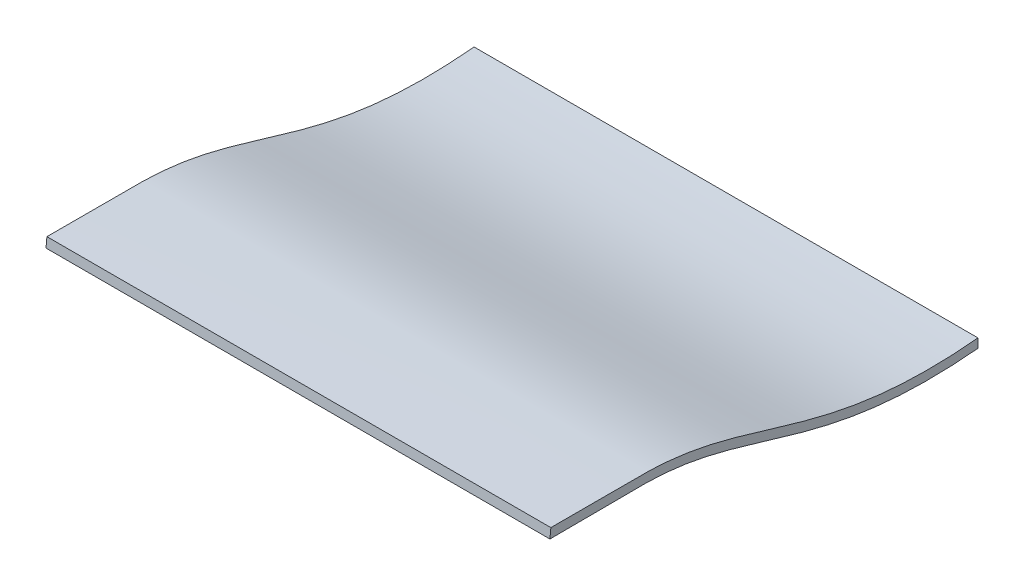
ISO-10303-21;
HEADER;
FILE_DESCRIPTION(('STEP AP214'),'2;1');
FILE_NAME('part.step','',(''),(''),'','','');
FILE_SCHEMA(('AUTOMOTIVE_DESIGN { 1 0 10303 214 1 1 1 1 }'));
ENDSEC;
DATA;
#1=APPLICATION_CONTEXT('core data for automotive mechanical design processes');
#2=APPLICATION_PROTOCOL_DEFINITION('international standard','automotive_design',2000,#1);
#3=PRODUCT_CONTEXT('',#1,'mechanical');
#4=PRODUCT('Part','Part','',(#3));
#5=PRODUCT_RELATED_PRODUCT_CATEGORY('part','',(#4));
#6=PRODUCT_DEFINITION_FORMATION('','',#4);
#7=PRODUCT_DEFINITION_CONTEXT('part definition',#1,'design');
#8=PRODUCT_DEFINITION('design','',#6,#7);
#9=PRODUCT_DEFINITION_SHAPE('','',#8);
#10=(LENGTH_UNIT() NAMED_UNIT(*) SI_UNIT(.MILLI.,.METRE.));
#11=(NAMED_UNIT(*) PLANE_ANGLE_UNIT() SI_UNIT($,.RADIAN.));
#12=(NAMED_UNIT(*) SI_UNIT($,.STERADIAN.) SOLID_ANGLE_UNIT());
#13=UNCERTAINTY_MEASURE_WITH_UNIT(LENGTH_MEASURE(1.E-05),#10,'distance_accuracy_value','');
#14=(GEOMETRIC_REPRESENTATION_CONTEXT(3) GLOBAL_UNCERTAINTY_ASSIGNED_CONTEXT((#13)) GLOBAL_UNIT_ASSIGNED_CONTEXT((#10,
#11,#12)) REPRESENTATION_CONTEXT('',''));
#15=CARTESIAN_POINT('',(0.,0.,0.));
#16=DIRECTION('',(0.,0.,1.));
#17=DIRECTION('',(1.,0.,0.));
#18=AXIS2_PLACEMENT_3D('',#15,#16,#17);
#19=CARTESIAN_POINT('',(2.8672,0.,4.));
#20=CARTESIAN_POINT('',(-3.92,0.,4.));
#21=CARTESIAN_POINT('',(2.8672,-0.024628468,4.256388466));
#22=CARTESIAN_POINT('',(-3.92,-0.024628468,4.256388466));
#23=CARTESIAN_POINT('',(2.8672,-0.038618016,4.72259081));
#24=CARTESIAN_POINT('',(-3.92,-0.038618016,4.72259081));
#25=CARTESIAN_POINT('',(2.8672,0.01947153,5.312011185));
#26=CARTESIAN_POINT('',(-3.92,0.01947153,5.312011185));
#27=CARTESIAN_POINT('',(2.8672,0.129906645,5.821389043));
#28=CARTESIAN_POINT('',(-3.92,0.129906645,5.821389043));
#29=CARTESIAN_POINT('',(2.8672,0.291873769,6.368027096));
#30=CARTESIAN_POINT('',(-3.92,0.291873769,6.368027096));
#31=CARTESIAN_POINT('',(2.8672,0.477782991,6.965975593));
#32=CARTESIAN_POINT('',(-3.92,0.477782991,6.965975593));
#33=CARTESIAN_POINT('',(2.8672,0.547843022,7.463268805));
#34=CARTESIAN_POINT('',(-3.92,0.547843022,7.463268805));
#35=CARTESIAN_POINT('',(2.8672,0.547843022,7.742133946));
#36=CARTESIAN_POINT('',(-3.92,0.547843022,7.742133946));
#37=CARTESIAN_POINT('',(2.8672,0.547843022,8.57930318693468));
#38=CARTESIAN_POINT('',(-3.92,0.547843022,8.57930318693468));
#39=CARTESIAN_POINT('',(2.8672,0.547843022,9.41647242786936));
#40=CARTESIAN_POINT('',(-3.92,0.547843022,9.41647242786936));
#41=CARTESIAN_POINT('',(2.8672,0.547843022,10.253641668804));
#42=CARTESIAN_POINT('',(-3.92,0.547843022,10.253641668804));
#43=B_SPLINE_SURFACE_WITH_KNOTS('',3,1,((#19,#20),(#21,#22),(#23,#24),(#25,#26),(#27,#28),(#29,
#30),(#31,#32),(#33,#34),(#35,#36),(#37,#38),(#39,#40),(#41,#42)),.UNSPECIFIED.,.F.,.F.,.F.,(4,
1,1,1,1,1,3,4),(2,2),(0.,0.14,0.28,0.42,0.559999999997895,0.780000000000162,1.,
1.66045269173853),(-0.00672,0.672),.UNSPECIFIED.);
#44=CARTESIAN_POINT('',(-2.8,0.547843022,8.74673703512159));
#45=CARTESIAN_POINT('',(-2.8,0.547842906702326,8.68528571674755));
#46=CARTESIAN_POINT('',(-2.8,0.547842964198973,8.62383439827284));
#47=CARTESIAN_POINT('',(-2.8,0.547843080107016,8.50060644710681));
#48=CARTESIAN_POINT('',(-2.8,0.547843138521643,8.43882981441547));
#49=CARTESIAN_POINT('',(-2.8,0.547842905081755,8.31506628140649));
#50=CARTESIAN_POINT('',(-2.8,0.54784261203436,8.25307938108954));
#51=CARTESIAN_POINT('',(-2.8,0.54784343259541,8.12901035819153));
#52=CARTESIAN_POINT('',(-2.8,0.547844548365387,8.06692823560921));
#53=CARTESIAN_POINT('',(-2.8,0.54784228226672,7.97475881607305));
#54=CARTESIAN_POINT('',(-2.8,0.547840921966892,7.94467151794153));
#55=CARTESIAN_POINT('',(-2.8,0.547845122145863,7.88449530220247));
#56=CARTESIAN_POINT('',(-2.8,0.547850682996255,7.85440638459473));
#57=CARTESIAN_POINT('',(-2.8,0.547839196398691,7.80929225221311));
#58=CARTESIAN_POINT('',(-2.8,0.547832073781566,7.79426703165736));
#59=CARTESIAN_POINT('',(-2.8,0.547853970254236,7.76421652035728));
#60=CARTESIAN_POINT('',(-2.8,0.547882989462217,7.74919122961287));
#61=CARTESIAN_POINT('',(-2.8,0.547783984428342,7.71914228667047));
#62=CARTESIAN_POINT('',(-2.8,0.547655976451005,7.70411863446392));
#63=CARTESIAN_POINT('',(-2.8,0.547182678089916,7.67407502080611));
#64=CARTESIAN_POINT('',(-2.8,0.546837390533576,7.65905505930935));
#65=CARTESIAN_POINT('',(-2.8,0.545498104294444,7.61408616045096));
#66=CARTESIAN_POINT('',(-2.8,0.544200462391214,7.58414561436942));
#67=CARTESIAN_POINT('',(-2.8,0.540781918126866,7.5243089237964));
#68=CARTESIAN_POINT('',(-2.8,0.538660916387852,7.49441278510221));
#69=CARTESIAN_POINT('',(-2.8,0.531084497477442,7.40491049720686));
#70=CARTESIAN_POINT('',(-2.8,0.524413060488041,7.3454037577374));
#71=CARTESIAN_POINT('',(-2.8,0.505054373277433,7.20553805547719));
#72=CARTESIAN_POINT('',(-2.8,0.49106741739192,7.12535976173874));
#73=CARTESIAN_POINT('',(-2.8,0.458348257888318,6.96576026035285));
#74=CARTESIAN_POINT('',(-2.8,0.439602277869368,6.88634195742287));
#75=CARTESIAN_POINT('',(-2.8,0.398804162548757,6.72826779878592));
#76=CARTESIAN_POINT('',(-2.8,0.376747614363769,6.6496131122451));
#77=CARTESIAN_POINT('',(-2.8,0.330896653138866,6.49237475511494));
#78=CARTESIAN_POINT('',(-2.8,0.307093689085984,6.41379364626243));
#79=CARTESIAN_POINT('',(-2.8,0.259573871282777,6.25673118750272));
#80=CARTESIAN_POINT('',(-2.8,0.235856942343488,6.17824986110475));
#81=CARTESIAN_POINT('',(-2.8,0.189972865135392,6.02085254458342));
#82=CARTESIAN_POINT('',(-2.8,0.167805232549242,5.94193669869016));
#83=CARTESIAN_POINT('',(-2.8,0.126099769165425,5.78297462889497));
#84=CARTESIAN_POINT('',(-2.8,0.106575783383594,5.70292470923044));
#85=CARTESIAN_POINT('',(-2.8,0.0711327721986367,5.54198267820483));
#86=CARTESIAN_POINT('',(-2.8,0.0552153901064553,5.46109020042868));
#87=CARTESIAN_POINT('',(-2.8,0.0274831509551212,5.29860395630055));
#88=CARTESIAN_POINT('',(-2.8,0.0156681085146804,5.21701022180858));
#89=CARTESIAN_POINT('',(-2.8,-0.00365394145678587,5.05365115991832));
#90=CARTESIAN_POINT('',(-2.8,-0.0111783002128884,4.97188788512288));
#91=CARTESIAN_POINT('',(-2.8,-0.0220647987660413,4.80807822579403));
#92=CARTESIAN_POINT('',(-2.8,-0.0254264454305133,4.72603180887268));
#93=CARTESIAN_POINT('',(-2.8,-0.0282081796048502,4.56189899319011));
#94=CARTESIAN_POINT('',(-2.8,-0.0276293976794587,4.47981261265323));
#95=CARTESIAN_POINT('',(-2.8,-0.0232940887268819,4.33140886200852));
#96=CARTESIAN_POINT('',(-2.8,-0.0201650529801226,4.26507158041845));
#97=CARTESIAN_POINT('',(-2.8,-0.0116978988822259,4.13245532577286));
#98=CARTESIAN_POINT('',(-2.8,-0.00635707039965284,4.06617652456653));
#99=CARTESIAN_POINT('',(-2.8,0.,4.));
#100=B_SPLINE_CURVE_WITH_KNOTS('',3,(#44,#45,#46,#47,#48,#49,#50,#51,#52,#53,#54,#55,#56,#57,
#58,#59,#60,#61,#62,#63,#64,#65,#66,#67,#68,#69,#70,#71,#72,#73,#74,#75,#76,#77,#78,#79,#80,#81,
#82,#83,#84,#85,#86,#87,#88,#89,#90,#91,#92,#93,#94,#95,#96,#97,#98,#99),.UNSPECIFIED.,.F.,.F.,
(4,2,2,2,2,2,2,2,2,2,2,2,2,2,2,2,2,2,2,2,2,2,2,2,2,2,2,4),(0.,0.184353955323629,
0.369683853295539,0.555644554758549,0.741890920555486,0.832152817327458,0.922419560432007,
0.967495234547427,1.01257105606386,1.05764220912332,1.10271277569349,1.19260620618809,
1.28251049001648,1.46205914291478,1.70604383123385,1.95074302330179,2.19577133701712,
2.44209177025096,2.68804945864641,2.93392991238468,3.18105199234312,3.42828644545333,
3.67550972479147,3.92172602834634,4.16797149694215,4.4141463172052,4.61334321924149,
4.81278492478183),.UNSPECIFIED.);
#101=CARTESIAN_POINT('',(-2.8,0.547843022,8.7467370351216));
#102=VERTEX_POINT('',#101);
#103=CARTESIAN_POINT('',(-2.8,0.,4.));
#104=VERTEX_POINT('',#103);
#105=EDGE_CURVE('E23',#102,#104,#100,.T.);
#106=DIRECTION('',(1.,0.,0.));
#107=VECTOR('',#106,1.);
#108=CARTESIAN_POINT('',(0.,0.547843022,8.74673703512162));
#109=LINE('',#108,#107);
#110=CARTESIAN_POINT('',(2.8,0.547843022,8.7467370351216));
#111=VERTEX_POINT('',#110);
#112=EDGE_CURVE('E64',#111,#102,#109,.F.);
#113=CARTESIAN_POINT('',(2.8,0.,4.));
#114=CARTESIAN_POINT('',(2.8,-0.00884743046204992,4.09205858219701));
#115=CARTESIAN_POINT('',(2.8,-0.0157227959919003,4.18433034520398));
#116=CARTESIAN_POINT('',(2.8,-0.0250705776314633,4.36921030327923));
#117=CARTESIAN_POINT('',(2.8,-0.0275374015249569,4.46181877654538));
#118=CARTESIAN_POINT('',(2.8,-0.0275844910846493,4.64707318642334));
#119=CARTESIAN_POINT('',(2.8,-0.0251634165216857,4.73971912634436));
#120=CARTESIAN_POINT('',(2.8,-0.0151702693742893,4.92285018551999));
#121=CARTESIAN_POINT('',(2.8,-0.00770377228910637,5.01334098714492));
#122=CARTESIAN_POINT('',(2.8,0.0124057404538056,5.19368091528302));
#123=CARTESIAN_POINT('',(2.8,0.0250450581813154,5.28353045363163));
#124=CARTESIAN_POINT('',(2.8,0.055295524818302,5.46228799230291));
#125=CARTESIAN_POINT('',(2.8,0.0729015629968635,5.55119686350463));
#126=CARTESIAN_POINT('',(2.8,0.106902452484785,5.70333505026525));
#127=CARTESIAN_POINT('',(2.8,0.122261992695236,5.76680053179104));
#128=CARTESIAN_POINT('',(2.8,0.154795780809255,5.89326590331332));
#129=CARTESIAN_POINT('',(2.8,0.17197015648176,5.95626576019416));
#130=CARTESIAN_POINT('',(2.8,0.207609416509552,6.0820341866934));
#131=CARTESIAN_POINT('',(2.8,0.226076861143274,6.14480202266021));
#132=CARTESIAN_POINT('',(2.8,0.263576065434319,6.2701696677427));
#133=CARTESIAN_POINT('',(2.8,0.282607881064201,6.33276945951636));
#134=CARTESIAN_POINT('',(2.8,0.339342837832746,6.52067130538712));
#135=CARTESIAN_POINT('',(2.8,0.376693554934573,6.64610182510756));
#136=CARTESIAN_POINT('',(2.8,0.426789565151415,6.83559559014639));
#137=CARTESIAN_POINT('',(2.8,0.44247493218745,6.89885962548878));
#138=CARTESIAN_POINT('',(2.8,0.471129988229087,7.02599107732407));
#139=CARTESIAN_POINT('',(2.8,0.484100341283253,7.08985834227338));
#140=CARTESIAN_POINT('',(2.8,0.506767336079929,7.21851795518392));
#141=CARTESIAN_POINT('',(2.8,0.516447085169036,7.28331334847186));
#142=CARTESIAN_POINT('',(2.8,0.528146294018996,7.38088824719804));
#143=CARTESIAN_POINT('',(2.8,0.531577558503533,7.41350283404392));
#144=CARTESIAN_POINT('',(2.8,0.537472390646986,7.47881643158059));
#145=CARTESIAN_POINT('',(2.8,0.539936073128194,7.51151543179027));
#146=CARTESIAN_POINT('',(2.8,0.543880754246365,7.57707670126507));
#147=CARTESIAN_POINT('',(2.8,0.545358615569614,7.60993915961647));
#148=CARTESIAN_POINT('',(2.8,0.54685117899047,7.6592557233188));
#149=CARTESIAN_POINT('',(2.8,0.547227996356305,7.67569950172081));
#150=CARTESIAN_POINT('',(2.8,0.547705404736432,7.70859144176619));
#151=CARTESIAN_POINT('',(2.8,0.547805987776157,7.72503960352237));
#152=CARTESIAN_POINT('',(2.8,0.547880023412574,7.75797686300814));
#153=CARTESIAN_POINT('',(2.8,0.547853156827478,7.77446596004081));
#154=CARTESIAN_POINT('',(2.8,0.547832887290195,7.80744403579182));
#155=CARTESIAN_POINT('',(2.8,0.547839483949478,7.82393301450929));
#156=CARTESIAN_POINT('',(2.8,0.547850097794964,7.87339850412885));
#157=CARTESIAN_POINT('',(2.8,0.547844940213279,7.90637499497928));
#158=CARTESIAN_POINT('',(2.8,0.547841054617476,7.97317327197277));
#159=CARTESIAN_POINT('',(2.8,0.547842494800152,8.00699505848345));
#160=CARTESIAN_POINT('',(2.8,0.547843549206849,8.07463907667339));
#161=CARTESIAN_POINT('',(2.8,0.547843163406621,8.1084613083526));
#162=CARTESIAN_POINT('',(2.8,0.547842880860223,8.17604194794232));
#163=CARTESIAN_POINT('',(2.8,0.54784298319255,8.20980035585081));
#164=CARTESIAN_POINT('',(2.8,0.547843060807309,8.27731704928939));
#165=CARTESIAN_POINT('',(2.8,0.547843036090201,8.31107533481947));
#166=CARTESIAN_POINT('',(2.8,0.547842993944022,8.41205208752087));
#167=CARTESIAN_POINT('',(2.8,0.547843008021134,8.47927055476103));
#168=CARTESIAN_POINT('',(2.8,0.547843035881305,8.61323835973819));
#169=CARTESIAN_POINT('',(2.8,0.54784304966573,8.67998769747519));
#170=CARTESIAN_POINT('',(2.8,0.547843022,8.74673703512159));
#171=B_SPLINE_CURVE_WITH_KNOTS('',3,(#113,#114,#115,#116,#117,#118,#119,#120,#121,#122,#123,
#124,#125,#126,#127,#128,#129,#130,#131,#132,#133,#134,#135,#136,#137,#138,#139,#140,#141,#142,
#143,#144,#145,#146,#147,#148,#149,#150,#151,#152,#153,#154,#155,#156,#157,#158,#159,#160,#161,
#162,#163,#164,#165,#166,#167,#168,#169,#170),.UNSPECIFIED.,.F.,.F.,(4,2,2,2,2,2,2,2,2,2,2,2,2,
2,2,2,2,2,2,2,2,2,2,2,2,2,2,2,4),(0.,0.277462266606104,0.5552762437618,0.833166406002992,
1.10541473416526,1.37746877728997,1.64924389290612,1.84510669939396,2.04098330430982,
2.23725935523744,2.43355493774901,2.82606442173887,3.02155488316188,3.21699747476353,
3.41342875254236,3.51180035622406,3.61016028268545,3.70883175873313,3.7581741608985,
3.80751798750718,3.85698545475782,3.9064523476588,4.0053818540261,4.10684720411547,
4.20831390168262,4.30958912473716,4.41086398148947,4.61251938311767,4.81276739623828),.UNSPECIFIED.);
#172=CARTESIAN_POINT('',(2.8,0.,4.));
#173=VERTEX_POINT('',#172);
#174=EDGE_CURVE('E77',#173,#111,#171,.T.);
#175=DIRECTION('',(1.,0.,0.));
#176=VECTOR('',#175,1.);
#177=CARTESIAN_POINT('',(0.,0.,4.));
#178=LINE('',#177,#176);
#179=EDGE_CURVE('E66',#173,#104,#178,.F.);
#180=ORIENTED_EDGE('',*,*,#105,.F.);
#181=ORIENTED_EDGE('',*,*,#112,.F.);
#182=ORIENTED_EDGE('',*,*,#174,.F.);
#183=ORIENTED_EDGE('',*,*,#179,.T.);
#184=EDGE_LOOP('',(#180,#181,#182,#183));
#185=FACE_BOUND('',#184,.T.);
#186=ADVANCED_FACE('F16',(#185),#43,.F.);
#187=CARTESIAN_POINT('',(-2.8,0.192627967,4.));
#188=DIRECTION('',(-1.,0.,0.));
#189=DIRECTION('',(0.,0.,1.));
#190=AXIS2_PLACEMENT_3D('',#187,#188,#189);
#191=PLANE('',#190);
#192=DIRECTION('',(0.,-0.995418002222509,0.095619040213487));
#193=VECTOR('',#192,1.);
#194=CARTESIAN_POINT('',(-2.8,0.543920262213487,8.74711385222251));
#195=LINE('',#194,#193);
#196=CARTESIAN_POINT('',(-2.8,0.442668977260629,8.75683996795073));
#197=VERTEX_POINT('',#196);
#198=EDGE_CURVE('E71',#102,#197,#195,.T.);
#199=ORIENTED_EDGE('',*,*,#198,.F.);
#200=ORIENTED_EDGE('',*,*,#105,.T.);
#201=DIRECTION('',(0.,1.,0.));
#202=VECTOR('',#201,1.);
#203=CARTESIAN_POINT('',(-2.8,-0.1,4.));
#204=LINE('',#203,#202);
#205=CARTESIAN_POINT('',(-2.8,-0.1,4.));
#206=VERTEX_POINT('',#205);
#207=EDGE_CURVE('E85',#104,#206,#204,.F.);
#208=ORIENTED_EDGE('',*,*,#207,.T.);
#209=CARTESIAN_POINT('',(-2.8,-0.1,4.));
#210=CARTESIAN_POINT('',(-2.8,-0.108905872787101,4.09474520944262));
#211=CARTESIAN_POINT('',(-2.8,-0.115789153962948,4.1897074515527));
#212=CARTESIAN_POINT('',(-2.8,-0.124989931256523,4.37995403207937));
#213=CARTESIAN_POINT('',(-2.8,-0.127302369388049,4.47523861056854));
#214=CARTESIAN_POINT('',(-2.8,-0.126818780818783,4.66582542472838));
#215=CARTESIAN_POINT('',(-2.8,-0.12402178582099,4.7611276603228));
#216=CARTESIAN_POINT('',(-2.8,-0.113048144902698,4.94950631638367));
#217=CARTESIAN_POINT('',(-2.8,-0.104980517394534,5.04258904340113));
#218=CARTESIAN_POINT('',(-2.8,-0.0834777878587851,5.22807357373039));
#219=CARTESIAN_POINT('',(-2.8,-0.0700463112012425,5.32047579411537));
#220=CARTESIAN_POINT('',(-2.8,-0.0460659967579736,5.45835332332887));
#221=CARTESIAN_POINT('',(-2.8,-0.0374381554607821,5.5041723570409));
#222=CARTESIAN_POINT('',(-2.8,-0.0189857232088821,5.59556286418674));
#223=CARTESIAN_POINT('',(-2.8,-0.00916129651699088,5.64113437070498));
#224=CARTESIAN_POINT('',(-2.8,0.0155671182570966,5.74947932695414));
#225=CARTESIAN_POINT('',(-2.8,0.0309729127038378,5.81213799274748));
#226=CARTESIAN_POINT('',(-2.8,0.0634872313896632,5.93701426318799));
#227=CARTESIAN_POINT('',(-2.8,0.0805959248745248,5.99923182333544));
#228=CARTESIAN_POINT('',(-2.8,0.133701177283009,6.18543382773715));
#229=CARTESIAN_POINT('',(-2.8,0.171461549029286,6.30890481440444));
#230=CARTESIAN_POINT('',(-2.8,0.227310585281221,6.49434791357856));
#231=CARTESIAN_POINT('',(-2.8,0.245796046913832,6.55620526739254));
#232=CARTESIAN_POINT('',(-2.8,0.281686067422485,6.68022985177974));
#233=CARTESIAN_POINT('',(-2.8,0.299090780495993,6.74239703677372));
#234=CARTESIAN_POINT('',(-2.8,0.331921619369486,6.86699277584998));
#235=CARTESIAN_POINT('',(-2.8,0.347355388066259,6.929419286883));
#236=CARTESIAN_POINT('',(-2.8,0.375539412252017,7.05487328306878));
#237=CARTESIAN_POINT('',(-2.8,0.388290363935862,7.11790060786076));
#238=CARTESIAN_POINT('',(-2.8,0.404923055608675,7.21310745048152));
#239=CARTESIAN_POINT('',(-2.8,0.410065411026173,7.24506855513573));
#240=CARTESIAN_POINT('',(-2.8,0.419429875752844,7.30912827829778));
#241=CARTESIAN_POINT('',(-2.8,0.423651930908881,7.34122690478454));
#242=CARTESIAN_POINT('',(-2.8,0.431130256220014,7.40558404973198));
#243=CARTESIAN_POINT('',(-2.8,0.434385107610895,7.43784273319446));
#244=CARTESIAN_POINT('',(-2.8,0.439889206173268,7.50244171907489));
#245=CARTESIAN_POINT('',(-2.8,0.442138605108399,7.5347820084336));
#246=CARTESIAN_POINT('',(-2.8,0.444751922462403,7.58338740533369));
#247=CARTESIAN_POINT('',(-2.8,0.445496849948542,7.59963287809563));
#248=CARTESIAN_POINT('',(-2.8,0.446730992637988,7.6321329865827));
#249=CARTESIAN_POINT('',(-2.8,0.447220218773499,7.64838762188634));
#250=CARTESIAN_POINT('',(-2.8,0.447941961489845,7.68090518168157));
#251=CARTESIAN_POINT('',(-2.8,0.448174436850442,7.69716810708491));
#252=CARTESIAN_POINT('',(-2.8,0.448337242978448,7.7215639524491));
#253=CARTESIAN_POINT('',(-2.8,0.448360525648154,7.72969632518401));
#254=CARTESIAN_POINT('',(-2.8,0.448336315686042,7.74596101646417));
#255=CARTESIAN_POINT('',(-2.8,0.448288822166695,7.75409333500745));
#256=CARTESIAN_POINT('',(-2.8,0.448148783420142,7.77853033934389));
#257=CARTESIAN_POINT('',(-2.8,0.448058927320061,7.79483498451979));
#258=CARTESIAN_POINT('',(-2.8,0.447877341397791,7.82744397730012));
#259=CARTESIAN_POINT('',(-2.8,0.44778561161309,7.84374832490398));
#260=CARTESIAN_POINT('',(-2.8,0.447510947642803,7.89265936329145));
#261=CARTESIAN_POINT('',(-2.8,0.447328527544684,7.92526604631015));
#262=CARTESIAN_POINT('',(-2.8,0.446958450186208,7.99134991848952));
#263=CARTESIAN_POINT('',(-2.8,0.446770783125569,8.02482710779822));
#264=CARTESIAN_POINT('',(-2.8,0.44639554540241,8.09178213059635));
#265=CARTESIAN_POINT('',(-2.8,0.44620797474182,8.12525996408576));
#266=CARTESIAN_POINT('',(-2.8,0.445645979505342,8.2255606697448));
#267=CARTESIAN_POINT('',(-2.8,0.445271527753725,8.29238354232488));
#268=CARTESIAN_POINT('',(-2.8,0.444524370254195,8.42572094308319));
#269=CARTESIAN_POINT('',(-2.8,0.444151664422522,8.49223547126267));
#270=CARTESIAN_POINT('',(-2.8,0.443408967767523,8.6247799889004));
#271=CARTESIAN_POINT('',(-2.8,0.443038976944517,8.69080997835864));
#272=CARTESIAN_POINT('',(-2.8,0.442668977260629,8.75683996795071));
#273=B_SPLINE_CURVE_WITH_KNOTS('',3,(#209,#210,#211,#212,#213,#214,#215,#216,#217,#218,#219,
#220,#221,#222,#223,#224,#225,#226,#227,#228,#229,#230,#231,#232,#233,#234,#235,#236,#237,#238,
#239,#240,#241,#242,#243,#244,#245,#246,#247,#248,#249,#250,#251,#252,#253,#254,#255,#256,#257,
#258,#259,#260,#261,#262,#263,#264,#265,#266,#267,#268,#269,#270,#271,#272),.UNSPECIFIED.,.F.,
.F.,(4,2,2,2,2,2,2,2,2,2,2,2,2,2,2,2,2,2,2,2,2,2,2,2,2,2,2,2,2,2,2,4),(0.,0.285506980144167,
0.571329719045214,0.85720663029884,1.13735004307945,1.41730442942976,1.55716367382693,
1.69700374045805,1.89054662021298,2.08410875482945,2.47142674369267,2.66510793330223,
2.85876142535276,3.05163956399039,3.24446758857313,3.34157265237801,3.43868342858493,
3.53593595856488,3.63317380422444,3.68195977354655,3.73074365691247,3.77953537118399,
3.80393231666072,3.82832956807602,3.87724433973849,3.92615813368494,4.02397973151109,
4.12441287247664,4.22484795054686,4.42531971476556,4.62486643208221,4.82295951041181),.UNSPECIFIED.);
#274=EDGE_CURVE('E81',#206,#197,#273,.T.);
#275=ORIENTED_EDGE('',*,*,#274,.T.);
#276=EDGE_LOOP('',(#199,#200,#208,#275));
#277=FACE_BOUND('',#276,.T.);
#278=ADVANCED_FACE('F80',(#277),#191,.T.);
#279=CARTESIAN_POINT('',(0.,0.543920262213487,8.74711385222251));
#280=DIRECTION('',(0.,0.095619040213487,0.995418002222509));
#281=DIRECTION('',(0.,-0.995418002222509,0.095619040213487));
#282=AXIS2_PLACEMENT_3D('',#279,#280,#281);
#283=PLANE('',#282);
#284=DIRECTION('',(0.,-0.995418002222516,0.0956190402134144));
#285=VECTOR('',#284,1.);
#286=CARTESIAN_POINT('',(2.8,0.547843022,8.74673703512162));
#287=LINE('',#286,#285);
#288=CARTESIAN_POINT('',(2.8,0.442668977260628,8.75683996795072));
#289=VERTEX_POINT('',#288);
#290=EDGE_CURVE('E76',#111,#289,#287,.T.);
#291=ORIENTED_EDGE('',*,*,#290,.F.);
#292=ORIENTED_EDGE('',*,*,#112,.T.);
#293=ORIENTED_EDGE('',*,*,#198,.T.);
#294=DIRECTION('',(1.,0.,0.));
#295=VECTOR('',#294,1.);
#296=CARTESIAN_POINT('',(0.5264,0.442668977260628,8.75683996795073));
#297=LINE('',#296,#295);
#298=EDGE_CURVE('E94',#197,#289,#297,.T.);
#299=ORIENTED_EDGE('',*,*,#298,.T.);
#300=EDGE_LOOP('',(#291,#292,#293,#299));
#301=FACE_BOUND('',#300,.T.);
#302=ADVANCED_FACE('F73',(#301),#283,.T.);
#303=CARTESIAN_POINT('',(2.8,0.192627967,4.));
#304=DIRECTION('',(1.,0.,0.));
#305=DIRECTION('',(0.,0.,-1.));
#306=AXIS2_PLACEMENT_3D('',#303,#304,#305);
#307=PLANE('',#306);
#308=ORIENTED_EDGE('',*,*,#290,.T.);
#309=CARTESIAN_POINT('',(2.8,0.442668977260628,8.75683996795071));
#310=CARTESIAN_POINT('',(2.8,0.443022769517232,8.69370434357405));
#311=CARTESIAN_POINT('',(2.8,0.443376536561082,8.63056871826974));
#312=CARTESIAN_POINT('',(2.8,0.444086461082776,8.50387083457539));
#313=CARTESIAN_POINT('',(2.8,0.444442618559852,8.44030857618531));
#314=CARTESIAN_POINT('',(2.8,0.44515652455737,8.31290927456473));
#315=CARTESIAN_POINT('',(2.8,0.445514273299738,8.24907223134241));
#316=CARTESIAN_POINT('',(2.8,0.446230253443424,8.12127519693405));
#317=CARTESIAN_POINT('',(2.8,0.446588484447419,8.0573152057334));
#318=CARTESIAN_POINT('',(2.8,0.447121825118356,7.9621933600159));
#319=CARTESIAN_POINT('',(2.8,0.447296639243029,7.93103149462533));
#320=CARTESIAN_POINT('',(2.8,0.447645259326617,7.86870518392382));
#321=CARTESIAN_POINT('',(2.8,0.447819065202119,7.83754073860981));
#322=CARTESIAN_POINT('',(2.8,0.44808254321719,7.79082260818634));
#323=CARTESIAN_POINT('',(2.8,0.448170748807619,7.77526886911899));
#324=CARTESIAN_POINT('',(2.8,0.448299055500652,7.75193826387571));
#325=CARTESIAN_POINT('',(2.8,0.44834115706138,7.74416147130148));
#326=CARTESIAN_POINT('',(2.8,0.448358491692599,7.72860785372105));
#327=CARTESIAN_POINT('',(2.8,0.448333725180821,7.72083102871535));
#328=CARTESIAN_POINT('',(2.8,0.448067481552221,7.68195299172935));
#329=CARTESIAN_POINT('',(2.8,0.447398820087371,7.65085331131764));
#330=CARTESIAN_POINT('',(2.8,0.445123291729685,7.58879570346055));
#331=CARTESIAN_POINT('',(2.8,0.443519651188001,7.55783765572052));
#332=CARTESIAN_POINT('',(2.8,0.439385421633136,7.49597814202826));
#333=CARTESIAN_POINT('',(2.8,0.436854672647036,7.46507668676645));
#334=CARTESIAN_POINT('',(2.8,0.430887109568496,7.40341633343199));
#335=CARTESIAN_POINT('',(2.8,0.427451897306951,7.37265728020427));
#336=CARTESIAN_POINT('',(2.8,0.419709352397858,7.31125228708801));
#337=CARTESIAN_POINT('',(2.8,0.415402076940872,7.28060633991603));
#338=CARTESIAN_POINT('',(2.8,0.396708716919685,7.15958367161176));
#339=CARTESIAN_POINT('',(2.8,0.379096020441463,7.06969563599302));
#340=CARTESIAN_POINT('',(2.8,0.338426736591256,6.8908343766821));
#341=CARTESIAN_POINT('',(2.8,0.315348114394206,6.80186641814778));
#342=CARTESIAN_POINT('',(2.8,0.266094908978391,6.62460553267331));
#343=CARTESIAN_POINT('',(2.8,0.239913606522974,6.53631452847198));
#344=CARTESIAN_POINT('',(2.8,0.186835136998944,6.35985117835199));
#345=CARTESIAN_POINT('',(2.8,0.159937224786757,6.27167906476384));
#346=CARTESIAN_POINT('',(2.8,0.107691834337165,6.09508049133885));
#347=CARTESIAN_POINT('',(2.8,0.0823409876022159,6.00665505754102));
#348=CARTESIAN_POINT('',(2.8,0.0349300159635712,5.82900916519259));
#349=CARTESIAN_POINT('',(2.8,0.0128663837243808,5.73978966320799));
#350=CARTESIAN_POINT('',(2.8,-0.0267092241829617,5.56103265157469));
#351=CARTESIAN_POINT('',(2.8,-0.0442539938218682,5.47150250546405));
#352=CARTESIAN_POINT('',(2.8,-0.0744147480151722,5.29150039786817));
#353=CARTESIAN_POINT('',(2.8,-0.0870248657233746,5.20102744581747));
#354=CARTESIAN_POINT('',(2.8,-0.107118325517803,5.0194427374583));
#355=CARTESIAN_POINT('',(2.8,-0.11459763207439,4.92833053512748));
#356=CARTESIAN_POINT('',(2.8,-0.124621547131855,4.74402703690103));
#357=CARTESIAN_POINT('',(2.8,-0.127065406368606,4.65083032678837));
#358=CARTESIAN_POINT('',(2.8,-0.127089355072687,4.46448435489056));
#359=CARTESIAN_POINT('',(2.8,-0.12467136414611,4.37133508889788));
#360=CARTESIAN_POINT('',(2.8,-0.115475127303655,4.18538871156509));
#361=CARTESIAN_POINT('',(2.8,-0.108703443259553,4.09259128131295));
#362=CARTESIAN_POINT('',(2.8,-0.1,4.));
#363=B_SPLINE_CURVE_WITH_KNOTS('',3,(#309,#310,#311,#312,#313,#314,#315,#316,#317,#318,#319,
#320,#321,#322,#323,#324,#325,#326,#327,#328,#329,#330,#331,#332,#333,#334,#335,#336,#337,#338,
#339,#340,#341,#342,#343,#344,#345,#346,#347,#348,#349,#350,#351,#352,#353,#354,#355,#356,#357,
#358,#359,#360,#361,#362),.UNSPECIFIED.,.F.,.F.,(4,2,2,2,2,2,2,2,2,2,2,2,2,2,2,2,2,2,2,2,2,2,2,
2,2,2,4),(0.,0.189409848492533,0.380099616316693,0.571613757265871,0.763496725133452,
0.856983811131696,0.950478524159842,0.997140589932767,1.02047117113615,1.04380160659157,
1.13710661624903,1.23009154619799,1.32309252829543,1.41592989808098,1.50876118149295,
1.78328249290021,2.0589299084933,2.33518557327125,2.61174066181496,2.88767036800021,
3.1633035260105,3.43687612004138,3.71077298560985,3.9848850326536,4.26443026524678,
4.54386514656606,4.8228798487563),.UNSPECIFIED.);
#364=CARTESIAN_POINT('',(2.8,-0.1,4.));
#365=VERTEX_POINT('',#364);
#366=EDGE_CURVE('E33',#289,#365,#363,.T.);
#367=ORIENTED_EDGE('',*,*,#366,.T.);
#368=DIRECTION('',(0.,1.,0.));
#369=VECTOR('',#368,1.);
#370=CARTESIAN_POINT('',(2.8,-0.1,4.));
#371=LINE('',#370,#369);
#372=EDGE_CURVE('E41',#365,#173,#371,.T.);
#373=ORIENTED_EDGE('',*,*,#372,.T.);
#374=ORIENTED_EDGE('',*,*,#174,.T.);
#375=EDGE_LOOP('',(#308,#367,#373,#374));
#376=FACE_BOUND('',#375,.T.);
#377=ADVANCED_FACE('F98',(#376),#307,.T.);
#378=CARTESIAN_POINT('',(0.,-0.1,4.));
#379=DIRECTION('',(0.,0.,1.));
#380=DIRECTION('',(1.,0.,0.));
#381=AXIS2_PLACEMENT_3D('',#378,#379,#380);
#382=PLANE('',#381);
#383=ORIENTED_EDGE('',*,*,#207,.F.);
#384=ORIENTED_EDGE('',*,*,#179,.F.);
#385=ORIENTED_EDGE('',*,*,#372,.F.);
#386=DIRECTION('',(-1.,0.,0.));
#387=VECTOR('',#386,1.);
#388=CARTESIAN_POINT('',(0.5264,-0.1,4.));
#389=LINE('',#388,#387);
#390=EDGE_CURVE('E11',#365,#206,#389,.T.);
#391=ORIENTED_EDGE('',*,*,#390,.T.);
#392=EDGE_LOOP('',(#383,#384,#385,#391));
#393=FACE_BOUND('',#392,.T.);
#394=ADVANCED_FACE('F103',(#393),#382,.F.);
#395=CARTESIAN_POINT('',(-2.8672,-0.1,4.));
#396=CARTESIAN_POINT('',(3.92,-0.1,4.));
#397=CARTESIAN_POINT('',(-2.8672,-0.124487823,4.260512861));
#398=CARTESIAN_POINT('',(3.92,-0.124487823,4.260512861));
#399=CARTESIAN_POINT('',(-2.8672,-0.138196079,4.734963994));
#400=CARTESIAN_POINT('',(3.92,-0.138196079,4.734963994));
#401=CARTESIAN_POINT('',(-2.8672,-0.077568446,5.337055167));
#402=CARTESIAN_POINT('',(3.92,-0.077568446,5.337055167));
#403=CARTESIAN_POINT('',(-2.8672,0.035994262,5.856090972));
#404=CARTESIAN_POINT('',(3.92,0.035994262,5.856090972));
#405=CARTESIAN_POINT('',(-2.8672,0.200282397,6.407901627));
#406=CARTESIAN_POINT('',(3.92,0.200282397,6.407901627));
#407=CARTESIAN_POINT('',(-2.8672,0.382793216,6.999767267));
#408=CARTESIAN_POINT('',(3.92,0.382793216,6.999767267));
#409=CARTESIAN_POINT('',(-2.8672,0.449818564,7.4809073));
#410=CARTESIAN_POINT('',(3.92,0.449818564,7.4809073));
#411=CARTESIAN_POINT('',(-2.8672,0.448301222,7.75169585));
#412=CARTESIAN_POINT('',(3.92,0.448301222,7.75169585));
#413=CARTESIAN_POINT('',(-2.8672,0.44360768471719,8.58931594829228));
#414=CARTESIAN_POINT('',(3.92,0.44360768471719,8.58931594829228));
#415=CARTESIAN_POINT('',(-2.8672,0.438914147434381,9.42693604658455));
#416=CARTESIAN_POINT('',(3.92,0.438914147434381,9.42693604658455));
#417=CARTESIAN_POINT('',(-2.8672,0.434220610151571,10.2645561448768));
#418=CARTESIAN_POINT('',(3.92,0.434220610151571,10.2645561448768));
#419=B_SPLINE_SURFACE_WITH_KNOTS('',3,1,((#395,#396),(#397,#398),(#399,#400),(#401,#402),(#403,
#404),(#405,#406),(#407,#408),(#409,#410),(#411,#412),(#413,#414),(#415,#416),(#417,#418)),
.UNSPECIFIED.,.F.,.F.,.F.,(4,1,1,1,1,1,3,4),(2,2),(0.,0.14,0.28,0.42,0.559999999997895,
0.780000000000162,1.,1.68051777530537),(-0.00672,0.672),.UNSPECIFIED.);
#420=ORIENTED_EDGE('',*,*,#366,.F.);
#421=ORIENTED_EDGE('',*,*,#298,.F.);
#422=ORIENTED_EDGE('',*,*,#274,.F.);
#423=ORIENTED_EDGE('',*,*,#390,.F.);
#424=EDGE_LOOP('',(#420,#421,#422,#423));
#425=FACE_BOUND('',#424,.T.);
#426=ADVANCED_FACE('F18',(#425),#419,.F.);
#427=CLOSED_SHELL('',(#186,#278,#302,#377,#394,#426));
#428=MANIFOLD_SOLID_BREP('B1',#427);
#429=ADVANCED_BREP_SHAPE_REPRESENTATION('',(#18,#428),#14);
#430=SHAPE_DEFINITION_REPRESENTATION(#9,#429);
ENDSEC;
END-ISO-10303-21;
